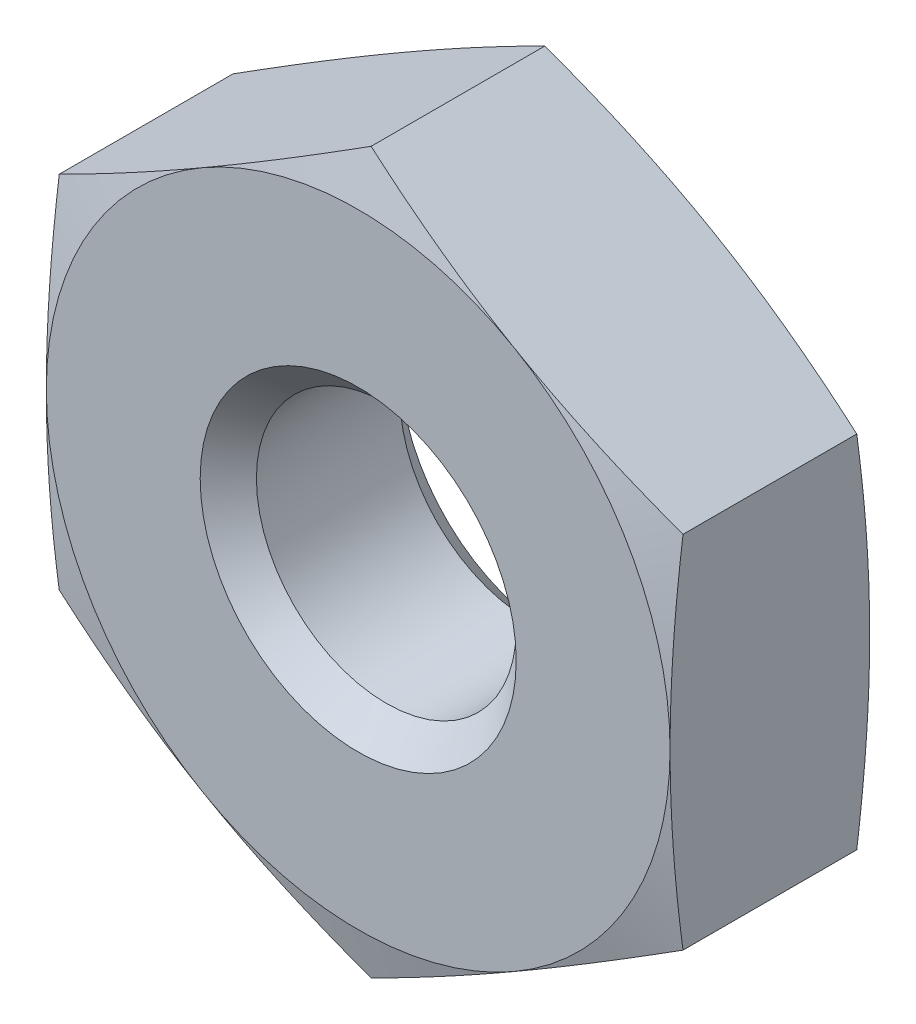
ISO-10303-21;
HEADER;
FILE_DESCRIPTION(('STEP AP214'),'2;1');
FILE_NAME('part.step','',(''),(''),'','','');
FILE_SCHEMA(('AUTOMOTIVE_DESIGN { 1 0 10303 214 1 1 1 1 }'));
ENDSEC;
DATA;
#1=APPLICATION_CONTEXT('core data for automotive mechanical design processes');
#2=APPLICATION_PROTOCOL_DEFINITION('international standard','automotive_design',2000,#1);
#3=PRODUCT_CONTEXT('',#1,'mechanical');
#4=PRODUCT('Part','Part','',(#3));
#5=PRODUCT_RELATED_PRODUCT_CATEGORY('part','',(#4));
#6=PRODUCT_DEFINITION_FORMATION('','',#4);
#7=PRODUCT_DEFINITION_CONTEXT('part definition',#1,'design');
#8=PRODUCT_DEFINITION('design','',#6,#7);
#9=PRODUCT_DEFINITION_SHAPE('','',#8);
#10=(LENGTH_UNIT() NAMED_UNIT(*) SI_UNIT(.MILLI.,.METRE.));
#11=(NAMED_UNIT(*) PLANE_ANGLE_UNIT() SI_UNIT($,.RADIAN.));
#12=(NAMED_UNIT(*) SI_UNIT($,.STERADIAN.) SOLID_ANGLE_UNIT());
#13=UNCERTAINTY_MEASURE_WITH_UNIT(LENGTH_MEASURE(1.E-05),#10,'distance_accuracy_value','');
#14=(GEOMETRIC_REPRESENTATION_CONTEXT(3) GLOBAL_UNCERTAINTY_ASSIGNED_CONTEXT((#13)) GLOBAL_UNIT_ASSIGNED_CONTEXT((#10,
#11,#12)) REPRESENTATION_CONTEXT('',''));
#15=CARTESIAN_POINT('',(0.,0.,0.));
#16=DIRECTION('',(0.,0.,1.));
#17=DIRECTION('',(1.,0.,0.));
#18=AXIS2_PLACEMENT_3D('',#15,#16,#17);
#19=CARTESIAN_POINT('',(0.,0.,0.));
#20=DIRECTION('',(0.,0.,-1.));
#21=DIRECTION('',(-1.,0.,0.));
#22=AXIS2_PLACEMENT_3D('',#19,#20,#21);
#23=PLANE('',#22);
#24=CARTESIAN_POINT('',(0.,0.,0.));
#25=DIRECTION('',(0.,0.,1.));
#26=DIRECTION('',(1.,0.,0.));
#27=AXIS2_PLACEMENT_3D('',#24,#25,#26);
#28=CIRCLE('',#27,4.7625);
#29=CARTESIAN_POINT('',(4.7625,0.,0.));
#30=VERTEX_POINT('',#29);
#31=CARTESIAN_POINT('',(2.38125000000001,4.1244459855234,0.));
#32=VERTEX_POINT('',#31);
#33=EDGE_CURVE('E11',#30,#32,#28,.T.);
#34=ORIENTED_EDGE('',*,*,#33,.T.);
#35=CARTESIAN_POINT('',(-2.38125000000001,4.1244459855234,0.));
#36=VERTEX_POINT('',#35);
#37=EDGE_CURVE('E43',#32,#36,#28,.T.);
#38=ORIENTED_EDGE('',*,*,#37,.T.);
#39=CARTESIAN_POINT('',(-4.7625,0.,0.));
#40=VERTEX_POINT('',#39);
#41=EDGE_CURVE('E328',#36,#40,#28,.T.);
#42=ORIENTED_EDGE('',*,*,#41,.T.);
#43=CARTESIAN_POINT('',(-2.38125000000001,-4.1244459855234,0.));
#44=VERTEX_POINT('',#43);
#45=EDGE_CURVE('E321',#40,#44,#28,.T.);
#46=ORIENTED_EDGE('',*,*,#45,.T.);
#47=CARTESIAN_POINT('',(2.38125000000001,-4.1244459855234,0.));
#48=VERTEX_POINT('',#47);
#49=EDGE_CURVE('E324',#44,#48,#28,.T.);
#50=ORIENTED_EDGE('',*,*,#49,.T.);
#51=EDGE_CURVE('E44',#48,#30,#28,.T.);
#52=ORIENTED_EDGE('',*,*,#51,.T.);
#53=EDGE_LOOP('',(#34,#38,#42,#46,#50,#52));
#54=FACE_BOUND('',#53,.T.);
#55=CARTESIAN_POINT('',(0.,0.,0.));
#56=DIRECTION('',(0.,0.,1.));
#57=DIRECTION('',(1.,0.,0.));
#58=AXIS2_PLACEMENT_3D('',#55,#56,#57);
#59=CIRCLE('',#58,2.413);
#60=CARTESIAN_POINT('',(2.413,0.,0.));
#61=VERTEX_POINT('',#60);
#62=EDGE_CURVE('E185',#61,#61,#59,.T.);
#63=ORIENTED_EDGE('',*,*,#62,.F.);
#64=EDGE_LOOP('',(#63));
#65=FACE_BOUND('',#64,.T.);
#66=ADVANCED_FACE('F36',(#54,#65),#23,.F.);
#67=CARTESIAN_POINT('',(0.,4.7625,-3.048));
#68=DIRECTION('',(0.,0.,1.));
#69=DIRECTION('',(1.,0.,0.));
#70=AXIS2_PLACEMENT_3D('',#67,#68,#69);
#71=PLANE('',#70);
#72=CARTESIAN_POINT('',(0.,0.,-3.048));
#73=DIRECTION('',(0.,0.,1.));
#74=DIRECTION('',(1.,0.,0.));
#75=AXIS2_PLACEMENT_3D('',#72,#73,#74);
#76=CIRCLE('',#75,4.7625);
#77=CARTESIAN_POINT('',(4.7625,0.,-3.048));
#78=VERTEX_POINT('',#77);
#79=CARTESIAN_POINT('',(2.38125000000001,4.1244459855234,-3.048));
#80=VERTEX_POINT('',#79);
#81=EDGE_CURVE('E359',#78,#80,#76,.T.);
#82=ORIENTED_EDGE('',*,*,#81,.F.);
#83=CARTESIAN_POINT('',(2.38125000000001,-4.1244459855234,-3.048));
#84=VERTEX_POINT('',#83);
#85=EDGE_CURVE('E362',#84,#78,#76,.T.);
#86=ORIENTED_EDGE('',*,*,#85,.F.);
#87=CARTESIAN_POINT('',(-2.38125000000001,-4.1244459855234,-3.048));
#88=VERTEX_POINT('',#87);
#89=EDGE_CURVE('E363',#88,#84,#76,.T.);
#90=ORIENTED_EDGE('',*,*,#89,.F.);
#91=CARTESIAN_POINT('',(-4.7625,0.,-3.048));
#92=VERTEX_POINT('',#91);
#93=EDGE_CURVE('E143',#92,#88,#76,.T.);
#94=ORIENTED_EDGE('',*,*,#93,.F.);
#95=CARTESIAN_POINT('',(-2.38125000000001,4.1244459855234,-3.048));
#96=VERTEX_POINT('',#95);
#97=EDGE_CURVE('E360',#96,#92,#76,.T.);
#98=ORIENTED_EDGE('',*,*,#97,.F.);
#99=EDGE_CURVE('E356',#80,#96,#76,.T.);
#100=ORIENTED_EDGE('',*,*,#99,.F.);
#101=EDGE_LOOP('',(#82,#86,#90,#94,#98,#100));
#102=FACE_BOUND('',#101,.T.);
#103=CARTESIAN_POINT('',(0.,0.,-3.048));
#104=DIRECTION('',(0.,0.,1.));
#105=DIRECTION('',(1.,0.,0.));
#106=AXIS2_PLACEMENT_3D('',#103,#104,#105);
#107=CIRCLE('',#106,2.413);
#108=CARTESIAN_POINT('',(2.413,0.,-3.048));
#109=VERTEX_POINT('',#108);
#110=EDGE_CURVE('E205',#109,#109,#107,.T.);
#111=ORIENTED_EDGE('',*,*,#110,.T.);
#112=EDGE_LOOP('',(#111));
#113=FACE_BOUND('',#112,.T.);
#114=ADVANCED_FACE('F209',(#102,#113),#71,.F.);
#115=CARTESIAN_POINT('',(0.,0.,-0.25522160579064));
#116=DIRECTION('',(0.,0.,-1.));
#117=DIRECTION('',(-1.,0.,0.));
#118=AXIS2_PLACEMENT_3D('',#115,#116,#117);
#119=CONICAL_SURFACE('',#118,5.715,1.30899693899575);
#120=CARTESIAN_POINT('',(-4.7627,2.74951518696176,-0.197445540191294));
#121=CARTESIAN_POINT('',(-4.56490877517695,2.86371000385669,-0.166833629235149));
#122=CARTESIAN_POINT('',(-4.36675892196618,2.97811187494782,-0.139043019383159));
#123=CARTESIAN_POINT('',(-3.96975940414776,3.20731965342844,-0.090217468531895));
#124=CARTESIAN_POINT('',(-3.77090948832601,3.32212570585646,-0.0691852718079106));
#125=CARTESIAN_POINT('',(-3.37371552682257,3.55144574645097,-0.0351044426334349));
#126=CARTESIAN_POINT('',(-3.17537416721689,3.66595818381074,-0.0220151656070741));
#127=CARTESIAN_POINT('',(-2.77843850081505,3.89512909765881,-0.0044637789460618));
#128=CARTESIAN_POINT('',(-2.57984425040752,4.0097875415911,0.));
#129=CARTESIAN_POINT('',(-2.18265574959247,4.2391044294557,0.));
#130=CARTESIAN_POINT('',(-1.98406149918495,4.35376287338799,-0.00446377894606255));
#131=CARTESIAN_POINT('',(-1.58712583278311,4.58293378723606,-0.0220151656070753));
#132=CARTESIAN_POINT('',(-1.38878447317743,4.69744622459584,-0.0351044426334363));
#133=CARTESIAN_POINT('',(-0.991590511673994,4.92676626519034,-0.0691852718079125));
#134=CARTESIAN_POINT('',(-0.79274059585224,5.04157231761836,-0.0902174685318972));
#135=CARTESIAN_POINT('',(-0.395741078033824,5.27078009609898,-0.139043019383162));
#136=CARTESIAN_POINT('',(-0.197591224823046,5.38518196719011,-0.166833629235152));
#137=CARTESIAN_POINT('',(0.000200000000000562,5.49937678408504,-0.197445540191297));
#138=B_SPLINE_CURVE_WITH_KNOTS('',3,(#120,#121,#122,#123,#124,#125,#126,#127,#128,#129,#130,
#131,#132,#133,#134,#135,#136,#137),.UNSPECIFIED.,.F.,.F.,(4,2,2,2,2,2,2,2,4),(0.,
0.691332271965001,1.38294490792359,2.07098798746551,2.75889789519172,3.44680780291792,
4.13485088245985,4.82646351841843,5.51779579038343),.UNSPECIFIED.);
#139=CARTESIAN_POINT('',(-4.7625,2.7496306570156,-0.197414599109147));
#140=VERTEX_POINT('',#139);
#141=EDGE_CURVE('E336',#140,#36,#138,.T.);
#142=ORIENTED_EDGE('',*,*,#141,.F.);
#143=CARTESIAN_POINT('',(-4.7625,-7.27378820104341,-1.05350026866726));
#144=CARTESIAN_POINT('',(-4.7625,-7.05772726305565,-1.00507832676799));
#145=CARTESIAN_POINT('',(-4.7625,-6.84153118574199,-0.957248587436731));
#146=CARTESIAN_POINT('',(-4.7625,-6.40880238366439,-0.863093170342623));
#147=CARTESIAN_POINT('',(-4.7625,-6.19226964478308,-0.81676755753862));
#148=CARTESIAN_POINT('',(-4.7625,-5.75860718227251,-0.725899735814738));
#149=CARTESIAN_POINT('',(-4.7625,-5.54147708139274,-0.681359320899419));
#150=CARTESIAN_POINT('',(-4.7625,-5.10676494415365,-0.594542660455404));
#151=CARTESIAN_POINT('',(-4.7625,-4.88918291162468,-0.552266395817578));
#152=CARTESIAN_POINT('',(-4.7625,-4.45522357117889,-0.470843012662113));
#153=CARTESIAN_POINT('',(-4.7625,-4.23885045336542,-0.431673672048276));
#154=CARTESIAN_POINT('',(-4.7625,-3.80551401793821,-0.356754667634231));
#155=CARTESIAN_POINT('',(-4.7625,-3.58855071341922,-0.321004928588058));
#156=CARTESIAN_POINT('',(-4.7625,-3.15399178662959,-0.253730066860368));
#157=CARTESIAN_POINT('',(-4.7625,-2.93639624557734,-0.222204424102948));
#158=CARTESIAN_POINT('',(-4.7625,-2.50051273157782,-0.164306764227813));
#159=CARTESIAN_POINT('',(-4.7625,-2.28222475798204,-0.137934751938309));
#160=CARTESIAN_POINT('',(-4.7625,-1.84249368491981,-0.0910911131261329));
#161=CARTESIAN_POINT('',(-4.7625,-1.62104295373776,-0.0706900639262618));
#162=CARTESIAN_POINT('',(-4.7625,-1.17758476151865,-0.0371957319502665));
#163=CARTESIAN_POINT('',(-4.7625,-0.955577313366654,-0.0241022815815293));
#164=CARTESIAN_POINT('',(-4.7625,-0.511327726224625,-0.00598680070252002));
#165=CARTESIAN_POINT('',(-4.7625,-0.289085739880909,-0.000961102236020668));
#166=CARTESIAN_POINT('',(-4.7625,0.155430183961466,0.000709849887994852));
#167=CARTESIAN_POINT('',(-4.7625,0.377704121432418,-0.00264488923023027));
#168=CARTESIAN_POINT('',(-4.7625,0.822780505992243,-0.017546022382038));
#169=CARTESIAN_POINT('',(-4.7625,1.04558193746731,-0.0291221471824264));
#170=CARTESIAN_POINT('',(-4.7625,1.49066069188238,-0.05980575965869));
#171=CARTESIAN_POINT('',(-4.7625,1.71293800310929,-0.0789134140749176));
#172=CARTESIAN_POINT('',(-4.7625,2.15696727018413,-0.123693062892535));
#173=CARTESIAN_POINT('',(-4.7625,2.37871878750097,-0.149369341214825));
#174=CARTESIAN_POINT('',(-4.7625,2.82150633529192,-0.206224697733119));
#175=CARTESIAN_POINT('',(-4.7625,3.04254236351744,-0.237403793205878));
#176=CARTESIAN_POINT('',(-4.7625,3.6753900052141,-0.333233763991723));
#177=CARTESIAN_POINT('',(-4.7625,4.0863537013855,-0.403456989945038));
#178=CARTESIAN_POINT('',(-4.7625,4.90636720913909,-0.55430442921292));
#179=CARTESIAN_POINT('',(-4.7625,5.31541677120842,-0.6349299613997));
#180=CARTESIAN_POINT('',(-4.7625,6.13216992988574,-0.80316417113105));
#181=CARTESIAN_POINT('',(-4.7625,6.53987317563588,-0.890774539174912));
#182=CARTESIAN_POINT('',(-4.7625,7.35419624322647,-1.07074688577446));
#183=CARTESIAN_POINT('',(-4.7625,7.76081612698248,-1.16310858638051));
#184=CARTESIAN_POINT('',(-4.7625,8.56928828454479,-1.35024707392398));
#185=CARTESIAN_POINT('',(-4.7625,8.97114814412675,-1.44499121070996));
#186=CARTESIAN_POINT('',(-4.7625,9.77430729039317,-1.6368520542413));
#187=CARTESIAN_POINT('',(-4.7625,10.1756065667243,-1.73396880420945));
#188=CARTESIAN_POINT('',(-4.7625,10.9772811149266,-1.92983378683962));
#189=CARTESIAN_POINT('',(-4.7625,11.3776569159364,-2.02857985831064));
#190=CARTESIAN_POINT('',(-4.7625,12.1780597656807,-2.22742035681909));
#191=CARTESIAN_POINT('',(-4.7625,12.5780868254884,-2.32751473925181));
#192=CARTESIAN_POINT('',(-4.7625,12.9779923445769,-2.42808669001593));
#193=B_SPLINE_CURVE_WITH_KNOTS('',3,(#143,#144,#145,#146,#147,#148,#149,#150,#151,#152,#153,
#154,#155,#156,#157,#158,#159,#160,#161,#162,#163,#164,#165,#166,#167,#168,#169,#170,#171,#172,
#173,#174,#175,#176,#177,#178,#179,#180,#181,#182,#183,#184,#185,#186,#187,#188,#189,#190,#191,
#192),.UNSPECIFIED.,.F.,.F.,(4,2,2,2,2,2,2,2,2,2,2,2,2,2,2,2,2,2,2,2,2,2,2,2,4),(0.,
0.6642640379174,1.32855672540963,1.99350104978659,2.65843976123677,3.3180875137926,
3.97772074791558,4.63727269241372,5.29682525481422,5.96388511231096,6.63092967081533,
7.29767087543394,7.96441150529626,8.63357560902586,9.30275452819558,9.97237098960278,
10.6419895533885,11.8925150523689,13.1431992572184,14.3941870821967,15.6451018082952,
16.8837244650886,18.1223697031849,19.3594864158202,20.5965623022993),.UNSPECIFIED.);
#194=EDGE_CURVE('E154',#40,#140,#193,.T.);
#195=ORIENTED_EDGE('',*,*,#194,.F.);
#196=ORIENTED_EDGE('',*,*,#41,.F.);
#197=EDGE_LOOP('',(#142,#195,#196));
#198=FACE_BOUND('',#197,.T.);
#199=ADVANCED_FACE('F227',(#198),#119,.T.);
#200=CARTESIAN_POINT('',(0.,5.4992613140312,-0.19741459910915));
#201=VERTEX_POINT('',#200);
#202=EDGE_CURVE('E333',#36,#201,#138,.T.);
#203=ORIENTED_EDGE('',*,*,#202,.F.);
#204=ORIENTED_EDGE('',*,*,#37,.F.);
#205=CARTESIAN_POINT('',(-0.000200000000000216,5.49937678408504,-0.197445540191297));
#206=CARTESIAN_POINT('',(0.197591224823046,5.38518196719011,-0.166833629235152));
#207=CARTESIAN_POINT('',(0.395741078033824,5.27078009609898,-0.139043019383161));
#208=CARTESIAN_POINT('',(0.792740595852239,5.04157231761836,-0.0902174685318972));
#209=CARTESIAN_POINT('',(0.991590511673994,4.92676626519034,-0.0691852718079125));
#210=CARTESIAN_POINT('',(1.38878447317743,4.69744622459584,-0.0351044426334362));
#211=CARTESIAN_POINT('',(1.58712583278311,4.58293378723606,-0.0220151656070753));
#212=CARTESIAN_POINT('',(1.98406149918495,4.35376287338799,-0.00446377894606248));
#213=CARTESIAN_POINT('',(2.18265574959247,4.2391044294557,0.));
#214=CARTESIAN_POINT('',(2.57984425040752,4.0097875415911,0.));
#215=CARTESIAN_POINT('',(2.77843850081505,3.89512909765881,-0.00446377894606186));
#216=CARTESIAN_POINT('',(3.17537416721689,3.66595818381074,-0.0220151656070741));
#217=CARTESIAN_POINT('',(3.37371552682257,3.55144574645097,-0.0351044426334347));
#218=CARTESIAN_POINT('',(3.77090948832601,3.32212570585646,-0.0691852718079104));
#219=CARTESIAN_POINT('',(3.96975940414776,3.20731965342844,-0.0902174685318949));
#220=CARTESIAN_POINT('',(4.36675892196618,2.97811187494782,-0.139043019383159));
#221=CARTESIAN_POINT('',(4.56490877517695,2.86371000385669,-0.166833629235149));
#222=CARTESIAN_POINT('',(4.7627,2.74951518696176,-0.197445540191294));
#223=B_SPLINE_CURVE_WITH_KNOTS('',3,(#205,#206,#207,#208,#209,#210,#211,#212,#213,#214,#215,
#216,#217,#218,#219,#220,#221,#222),.UNSPECIFIED.,.F.,.F.,(4,2,2,2,2,2,2,2,4),(0.,
0.691332271965001,1.38294490792359,2.07098798746551,2.75889789519172,3.44680780291792,
4.13485088245985,4.82646351841843,5.51779579038343),.UNSPECIFIED.);
#224=EDGE_CURVE('E266',#201,#32,#223,.T.);
#225=ORIENTED_EDGE('',*,*,#224,.F.);
#226=EDGE_LOOP('',(#203,#204,#225));
#227=FACE_BOUND('',#226,.T.);
#228=ADVANCED_FACE('F275',(#227),#119,.T.);
#229=CARTESIAN_POINT('',(4.7625,2.7496306570156,-0.197414599109147));
#230=VERTEX_POINT('',#229);
#231=EDGE_CURVE('E261',#32,#230,#223,.T.);
#232=ORIENTED_EDGE('',*,*,#231,.F.);
#233=ORIENTED_EDGE('',*,*,#33,.F.);
#234=CARTESIAN_POINT('',(4.7625,-7.27378820104341,-1.05350026866726));
#235=CARTESIAN_POINT('',(4.7625,-7.05772726305565,-1.00507832676799));
#236=CARTESIAN_POINT('',(4.7625,-6.84153118574199,-0.957248587436731));
#237=CARTESIAN_POINT('',(4.7625,-6.40880238366439,-0.863093170342623));
#238=CARTESIAN_POINT('',(4.7625,-6.19226964478308,-0.81676755753862));
#239=CARTESIAN_POINT('',(4.7625,-5.75860718227251,-0.725899735814738));
#240=CARTESIAN_POINT('',(4.7625,-5.54147708139274,-0.681359320899419));
#241=CARTESIAN_POINT('',(4.7625,-5.10676494415365,-0.594542660455404));
#242=CARTESIAN_POINT('',(4.7625,-4.88918291162468,-0.552266395817578));
#243=CARTESIAN_POINT('',(4.7625,-4.45522357117889,-0.470843012662113));
#244=CARTESIAN_POINT('',(4.7625,-4.23885045336542,-0.431673672048276));
#245=CARTESIAN_POINT('',(4.7625,-3.80551401793821,-0.356754667634231));
#246=CARTESIAN_POINT('',(4.7625,-3.58855071341922,-0.321004928588058));
#247=CARTESIAN_POINT('',(4.7625,-3.15399178662959,-0.253730066860368));
#248=CARTESIAN_POINT('',(4.7625,-2.93639624557734,-0.222204424102948));
#249=CARTESIAN_POINT('',(4.7625,-2.50051273157782,-0.164306764227813));
#250=CARTESIAN_POINT('',(4.7625,-2.28222475798204,-0.137934751938309));
#251=CARTESIAN_POINT('',(4.7625,-1.84249368491981,-0.0910911131261329));
#252=CARTESIAN_POINT('',(4.7625,-1.62104295373776,-0.0706900639262618));
#253=CARTESIAN_POINT('',(4.7625,-1.17758476151865,-0.0371957319502665));
#254=CARTESIAN_POINT('',(4.7625,-0.955577313366654,-0.0241022815815293));
#255=CARTESIAN_POINT('',(4.7625,-0.511327726224625,-0.00598680070252002));
#256=CARTESIAN_POINT('',(4.7625,-0.289085739880909,-0.000961102236020668));
#257=CARTESIAN_POINT('',(4.7625,0.155430183961466,0.000709849887994852));
#258=CARTESIAN_POINT('',(4.7625,0.377704121432418,-0.00264488923023027));
#259=CARTESIAN_POINT('',(4.7625,0.822780505992243,-0.017546022382038));
#260=CARTESIAN_POINT('',(4.7625,1.04558193746731,-0.0291221471824264));
#261=CARTESIAN_POINT('',(4.7625,1.49066069188238,-0.05980575965869));
#262=CARTESIAN_POINT('',(4.7625,1.71293800310929,-0.0789134140749176));
#263=CARTESIAN_POINT('',(4.7625,2.15696727018413,-0.123693062892535));
#264=CARTESIAN_POINT('',(4.7625,2.37871878750097,-0.149369341214825));
#265=CARTESIAN_POINT('',(4.7625,2.82150633529192,-0.206224697733119));
#266=CARTESIAN_POINT('',(4.7625,3.04254236351744,-0.237403793205878));
#267=CARTESIAN_POINT('',(4.7625,3.6753900052141,-0.333233763991723));
#268=CARTESIAN_POINT('',(4.7625,4.0863537013855,-0.403456989945038));
#269=CARTESIAN_POINT('',(4.7625,4.90636720913909,-0.55430442921292));
#270=CARTESIAN_POINT('',(4.7625,5.31541677120842,-0.6349299613997));
#271=CARTESIAN_POINT('',(4.7625,6.13216992988574,-0.80316417113105));
#272=CARTESIAN_POINT('',(4.7625,6.53987317563588,-0.890774539174912));
#273=CARTESIAN_POINT('',(4.7625,7.35419624322647,-1.07074688577446));
#274=CARTESIAN_POINT('',(4.7625,7.76081612698248,-1.16310858638051));
#275=CARTESIAN_POINT('',(4.7625,8.56928828454479,-1.35024707392398));
#276=CARTESIAN_POINT('',(4.7625,8.97114814412675,-1.44499121070996));
#277=CARTESIAN_POINT('',(4.7625,9.77430729039317,-1.6368520542413));
#278=CARTESIAN_POINT('',(4.7625,10.1756065667243,-1.73396880420945));
#279=CARTESIAN_POINT('',(4.7625,10.9772811149266,-1.92983378683962));
#280=CARTESIAN_POINT('',(4.7625,11.3776569159364,-2.02857985831064));
#281=CARTESIAN_POINT('',(4.7625,12.1780597656807,-2.22742035681909));
#282=CARTESIAN_POINT('',(4.7625,12.5780868254884,-2.32751473925181));
#283=CARTESIAN_POINT('',(4.7625,12.9779923445769,-2.42808669001593));
#284=B_SPLINE_CURVE_WITH_KNOTS('',3,(#234,#235,#236,#237,#238,#239,#240,#241,#242,#243,#244,
#245,#246,#247,#248,#249,#250,#251,#252,#253,#254,#255,#256,#257,#258,#259,#260,#261,#262,#263,
#264,#265,#266,#267,#268,#269,#270,#271,#272,#273,#274,#275,#276,#277,#278,#279,#280,#281,#282,
#283),.UNSPECIFIED.,.F.,.F.,(4,2,2,2,2,2,2,2,2,2,2,2,2,2,2,2,2,2,2,2,2,2,2,2,4),(0.,
0.6642640379174,1.32855672540963,1.99350104978659,2.65843976123677,3.3180875137926,
3.97772074791558,4.63727269241372,5.29682525481422,5.96388511231096,6.63092967081533,
7.29767087543394,7.96441150529626,8.63357560902586,9.30275452819558,9.97237098960278,
10.6419895533885,11.8925150523689,13.1431992572184,14.3941870821967,15.6451018082952,
16.8837244650886,18.1223697031849,19.3594864158202,20.5965623022993),.UNSPECIFIED.);
#285=EDGE_CURVE('E293',#230,#30,#284,.F.);
#286=ORIENTED_EDGE('',*,*,#285,.F.);
#287=EDGE_LOOP('',(#232,#233,#286));
#288=FACE_BOUND('',#287,.T.);
#289=ADVANCED_FACE('F347',(#288),#119,.T.);
#290=CARTESIAN_POINT('',(4.7625,-2.7496306570156,-0.197414599109147));
#291=VERTEX_POINT('',#290);
#292=EDGE_CURVE('E289',#30,#291,#284,.F.);
#293=ORIENTED_EDGE('',*,*,#292,.F.);
#294=ORIENTED_EDGE('',*,*,#51,.F.);
#295=CARTESIAN_POINT('',(4.7627,-2.74951518696176,-0.197445540191294));
#296=CARTESIAN_POINT('',(4.56490877517695,-2.86371000385669,-0.166833629235149));
#297=CARTESIAN_POINT('',(4.36675892196618,-2.97811187494782,-0.139043019383159));
#298=CARTESIAN_POINT('',(3.96975940414776,-3.20731965342844,-0.090217468531895));
#299=CARTESIAN_POINT('',(3.77090948832601,-3.32212570585646,-0.0691852718079106));
#300=CARTESIAN_POINT('',(3.37371552682257,-3.55144574645097,-0.0351044426334349));
#301=CARTESIAN_POINT('',(3.17537416721689,-3.66595818381074,-0.0220151656070741));
#302=CARTESIAN_POINT('',(2.77843850081505,-3.89512909765881,-0.0044637789460618));
#303=CARTESIAN_POINT('',(2.57984425040752,-4.0097875415911,0.));
#304=CARTESIAN_POINT('',(2.18265574959247,-4.2391044294557,0.));
#305=CARTESIAN_POINT('',(1.98406149918495,-4.35376287338799,-0.00446377894606255));
#306=CARTESIAN_POINT('',(1.58712583278311,-4.58293378723606,-0.0220151656070753));
#307=CARTESIAN_POINT('',(1.38878447317743,-4.69744622459584,-0.0351044426334363));
#308=CARTESIAN_POINT('',(0.991590511673994,-4.92676626519034,-0.0691852718079125));
#309=CARTESIAN_POINT('',(0.79274059585224,-5.04157231761836,-0.0902174685318972));
#310=CARTESIAN_POINT('',(0.395741078033824,-5.27078009609898,-0.139043019383162));
#311=CARTESIAN_POINT('',(0.197591224823046,-5.38518196719011,-0.166833629235152));
#312=CARTESIAN_POINT('',(-0.000200000000000562,-5.49937678408504,-0.197445540191297));
#313=B_SPLINE_CURVE_WITH_KNOTS('',3,(#295,#296,#297,#298,#299,#300,#301,#302,#303,#304,#305,
#306,#307,#308,#309,#310,#311,#312),.UNSPECIFIED.,.F.,.F.,(4,2,2,2,2,2,2,2,4),(0.,
0.691332271965001,1.38294490792359,2.07098798746551,2.75889789519172,3.44680780291792,
4.13485088245985,4.82646351841843,5.51779579038343),.UNSPECIFIED.);
#314=EDGE_CURVE('E299',#291,#48,#313,.T.);
#315=ORIENTED_EDGE('',*,*,#314,.F.);
#316=EDGE_LOOP('',(#293,#294,#315));
#317=FACE_BOUND('',#316,.T.);
#318=ADVANCED_FACE('F387',(#317),#119,.T.);
#319=CARTESIAN_POINT('',(0.,-5.4992613140312,-0.19741459910915));
#320=VERTEX_POINT('',#319);
#321=EDGE_CURVE('E284',#48,#320,#313,.T.);
#322=ORIENTED_EDGE('',*,*,#321,.F.);
#323=ORIENTED_EDGE('',*,*,#49,.F.);
#324=CARTESIAN_POINT('',(0.000200000000000216,-5.49937678408504,-0.197445540191297));
#325=CARTESIAN_POINT('',(-0.197591224823046,-5.38518196719011,-0.166833629235152));
#326=CARTESIAN_POINT('',(-0.395741078033824,-5.27078009609898,-0.139043019383161));
#327=CARTESIAN_POINT('',(-0.792740595852239,-5.04157231761836,-0.0902174685318972));
#328=CARTESIAN_POINT('',(-0.991590511673994,-4.92676626519034,-0.0691852718079125));
#329=CARTESIAN_POINT('',(-1.38878447317743,-4.69744622459584,-0.0351044426334362));
#330=CARTESIAN_POINT('',(-1.58712583278311,-4.58293378723606,-0.0220151656070753));
#331=CARTESIAN_POINT('',(-1.98406149918495,-4.35376287338799,-0.00446377894606248));
#332=CARTESIAN_POINT('',(-2.18265574959247,-4.2391044294557,0.));
#333=CARTESIAN_POINT('',(-2.57984425040752,-4.0097875415911,0.));
#334=CARTESIAN_POINT('',(-2.77843850081505,-3.89512909765881,-0.00446377894606186));
#335=CARTESIAN_POINT('',(-3.17537416721689,-3.66595818381074,-0.0220151656070741));
#336=CARTESIAN_POINT('',(-3.37371552682257,-3.55144574645097,-0.0351044426334347));
#337=CARTESIAN_POINT('',(-3.77090948832601,-3.32212570585646,-0.0691852718079104));
#338=CARTESIAN_POINT('',(-3.96975940414776,-3.20731965342844,-0.0902174685318949));
#339=CARTESIAN_POINT('',(-4.36675892196618,-2.97811187494782,-0.139043019383159));
#340=CARTESIAN_POINT('',(-4.56490877517695,-2.86371000385669,-0.166833629235149));
#341=CARTESIAN_POINT('',(-4.7627,-2.74951518696176,-0.197445540191294));
#342=B_SPLINE_CURVE_WITH_KNOTS('',3,(#324,#325,#326,#327,#328,#329,#330,#331,#332,#333,#334,
#335,#336,#337,#338,#339,#340,#341),.UNSPECIFIED.,.F.,.F.,(4,2,2,2,2,2,2,2,4),(0.,
0.691332271965001,1.38294490792359,2.07098798746551,2.75889789519172,3.44680780291792,
4.13485088245985,4.82646351841843,5.51779579038343),.UNSPECIFIED.);
#343=EDGE_CURVE('E146',#320,#44,#342,.T.);
#344=ORIENTED_EDGE('',*,*,#343,.F.);
#345=EDGE_LOOP('',(#322,#323,#344));
#346=FACE_BOUND('',#345,.T.);
#347=ADVANCED_FACE('F325',(#346),#119,.T.);
#348=CARTESIAN_POINT('',(-4.7625,-2.7496306570156,-0.197414599109147));
#349=VERTEX_POINT('',#348);
#350=EDGE_CURVE('E138',#44,#349,#342,.T.);
#351=ORIENTED_EDGE('',*,*,#350,.F.);
#352=ORIENTED_EDGE('',*,*,#45,.F.);
#353=EDGE_CURVE('E51',#349,#40,#193,.T.);
#354=ORIENTED_EDGE('',*,*,#353,.F.);
#355=EDGE_LOOP('',(#351,#352,#354));
#356=FACE_BOUND('',#355,.T.);
#357=ADVANCED_FACE('F277',(#356),#119,.T.);
#358=CARTESIAN_POINT('',(0.,5.4992613140312,-3.048));
#359=DIRECTION('',(-0.500000000000001,0.866025403784438,0.));
#360=DIRECTION('',(-0.866025403784438,-0.500000000000001,0.));
#361=AXIS2_PLACEMENT_3D('',#358,#359,#360);
#362=PLANE('',#361);
#363=ORIENTED_EDGE('',*,*,#141,.T.);
#364=ORIENTED_EDGE('',*,*,#202,.T.);
#365=DIRECTION('',(0.,0.,1.));
#366=VECTOR('',#365,1.);
#367=CARTESIAN_POINT('',(0.,5.4992613140312,-3.048));
#368=LINE('',#367,#366);
#369=CARTESIAN_POINT('',(0.,5.4992613140312,-2.85058540089088));
#370=VERTEX_POINT('',#369);
#371=EDGE_CURVE('E131',#370,#201,#368,.T.);
#372=ORIENTED_EDGE('',*,*,#371,.F.);
#373=CARTESIAN_POINT('',(0.000200000000000035,5.49937678408504,-2.85055445980873));
#374=CARTESIAN_POINT('',(-0.197591224823046,5.38518196719011,-2.88116637076487));
#375=CARTESIAN_POINT('',(-0.395741078033824,5.27078009609898,-2.90895698061686));
#376=CARTESIAN_POINT('',(-0.79274059585224,5.04157231761836,-2.95778253146812));
#377=CARTESIAN_POINT('',(-0.991590511673994,4.92676626519034,-2.9788147281921));
#378=CARTESIAN_POINT('',(-1.38878447317743,4.69744622459584,-3.01289555736657));
#379=CARTESIAN_POINT('',(-1.58712583278311,4.58293378723606,-3.02598483439293));
#380=CARTESIAN_POINT('',(-1.98406149918495,4.35376287338799,-3.04353622105394));
#381=CARTESIAN_POINT('',(-2.18265574959247,4.2391044294557,-3.048));
#382=CARTESIAN_POINT('',(-2.57984425040752,4.0097875415911,-3.048));
#383=CARTESIAN_POINT('',(-2.77843850081505,3.89512909765881,-3.04353622105394));
#384=CARTESIAN_POINT('',(-3.17537416721689,3.66595818381074,-3.02598483439293));
#385=CARTESIAN_POINT('',(-3.37371552682257,3.55144574645097,-3.01289555736657));
#386=CARTESIAN_POINT('',(-3.77090948832601,3.32212570585646,-2.9788147281921));
#387=CARTESIAN_POINT('',(-3.96975940414776,3.20731965342844,-2.95778253146812));
#388=CARTESIAN_POINT('',(-4.36675892196618,2.97811187494782,-2.90895698061686));
#389=CARTESIAN_POINT('',(-4.56490877517695,2.86371000385669,-2.88116637076488));
#390=CARTESIAN_POINT('',(-4.7627,2.74951518696176,-2.85055445980874));
#391=B_SPLINE_CURVE_WITH_KNOTS('',3,(#373,#374,#375,#376,#377,#378,#379,#380,#381,#382,#383,
#384,#385,#386,#387,#388,#389,#390),.UNSPECIFIED.,.F.,.F.,(4,2,2,2,2,2,2,2,4),(0.,
0.691332271964999,1.38294490792358,2.07098798746551,2.75889789519171,3.44680780291792,
4.13485088245984,4.82646351841843,5.51779579038343),.UNSPECIFIED.);
#392=EDGE_CURVE('E337',#370,#96,#391,.T.);
#393=ORIENTED_EDGE('',*,*,#392,.T.);
#394=CARTESIAN_POINT('',(-4.7625,2.7496306570156,-2.85058540089088));
#395=VERTEX_POINT('',#394);
#396=EDGE_CURVE('E268',#96,#395,#391,.T.);
#397=ORIENTED_EDGE('',*,*,#396,.T.);
#398=DIRECTION('',(0.,0.,1.));
#399=VECTOR('',#398,1.);
#400=CARTESIAN_POINT('',(-4.7625,2.7496306570156,-3.048));
#401=LINE('',#400,#399);
#402=EDGE_CURVE('E140',#395,#140,#401,.T.);
#403=ORIENTED_EDGE('',*,*,#402,.T.);
#404=EDGE_LOOP('',(#363,#364,#372,#393,#397,#403));
#405=FACE_BOUND('',#404,.T.);
#406=ADVANCED_FACE('F177',(#405),#362,.T.);
#407=CARTESIAN_POINT('',(4.7625,2.7496306570156,-3.048));
#408=DIRECTION('',(0.500000000000001,0.866025403784438,0.));
#409=DIRECTION('',(-0.866025403784438,0.500000000000001,0.));
#410=AXIS2_PLACEMENT_3D('',#407,#408,#409);
#411=PLANE('',#410);
#412=ORIENTED_EDGE('',*,*,#224,.T.);
#413=ORIENTED_EDGE('',*,*,#231,.T.);
#414=DIRECTION('',(0.,0.,1.));
#415=VECTOR('',#414,1.);
#416=CARTESIAN_POINT('',(4.7625,2.7496306570156,-3.048));
#417=LINE('',#416,#415);
#418=CARTESIAN_POINT('',(4.7625,2.7496306570156,-2.85058540089088));
#419=VERTEX_POINT('',#418);
#420=EDGE_CURVE('E192',#419,#230,#417,.T.);
#421=ORIENTED_EDGE('',*,*,#420,.F.);
#422=CARTESIAN_POINT('',(4.7627,2.74951518696176,-2.85055445980874));
#423=CARTESIAN_POINT('',(4.56490877517695,2.86371000385669,-2.88116637076488));
#424=CARTESIAN_POINT('',(4.36675892196618,2.97811187494782,-2.90895698061686));
#425=CARTESIAN_POINT('',(3.96975940414776,3.20731965342844,-2.95778253146812));
#426=CARTESIAN_POINT('',(3.77090948832601,3.32212570585646,-2.9788147281921));
#427=CARTESIAN_POINT('',(3.37371552682257,3.55144574645097,-3.01289555736657));
#428=CARTESIAN_POINT('',(3.17537416721689,3.66595818381074,-3.02598483439293));
#429=CARTESIAN_POINT('',(2.77843850081505,3.89512909765881,-3.04353622105394));
#430=CARTESIAN_POINT('',(2.57984425040752,4.0097875415911,-3.048));
#431=CARTESIAN_POINT('',(2.18265574959247,4.2391044294557,-3.048));
#432=CARTESIAN_POINT('',(1.98406149918495,4.353762873388,-3.04353622105394));
#433=CARTESIAN_POINT('',(1.58712583278311,4.58293378723606,-3.02598483439293));
#434=CARTESIAN_POINT('',(1.38878447317743,4.69744622459584,-3.01289555736657));
#435=CARTESIAN_POINT('',(0.991590511673993,4.92676626519034,-2.9788147281921));
#436=CARTESIAN_POINT('',(0.792740595852239,5.04157231761836,-2.95778253146812));
#437=CARTESIAN_POINT('',(0.395741078033824,5.27078009609898,-2.90895698061686));
#438=CARTESIAN_POINT('',(0.197591224823046,5.38518196719011,-2.88116637076487));
#439=CARTESIAN_POINT('',(-0.000200000000000554,5.49937678408504,-2.85055445980873));
#440=B_SPLINE_CURVE_WITH_KNOTS('',3,(#422,#423,#424,#425,#426,#427,#428,#429,#430,#431,#432,
#433,#434,#435,#436,#437,#438,#439),.UNSPECIFIED.,.F.,.F.,(4,2,2,2,2,2,2,2,4),(0.,
0.691332271964999,1.38294490792358,2.07098798746551,2.75889789519171,3.44680780291792,
4.13485088245984,4.82646351841843,5.51779579038343),.UNSPECIFIED.);
#441=EDGE_CURVE('E267',#419,#80,#440,.T.);
#442=ORIENTED_EDGE('',*,*,#441,.T.);
#443=EDGE_CURVE('E255',#80,#370,#440,.T.);
#444=ORIENTED_EDGE('',*,*,#443,.T.);
#445=ORIENTED_EDGE('',*,*,#371,.T.);
#446=EDGE_LOOP('',(#412,#413,#421,#442,#444,#445));
#447=FACE_BOUND('',#446,.T.);
#448=ADVANCED_FACE('F247',(#447),#411,.T.);
#449=CARTESIAN_POINT('',(4.7625,-2.7496306570156,-3.048));
#450=DIRECTION('',(1.,0.,0.));
#451=DIRECTION('',(0.,0.,-1.));
#452=AXIS2_PLACEMENT_3D('',#449,#450,#451);
#453=PLANE('',#452);
#454=ORIENTED_EDGE('',*,*,#285,.T.);
#455=ORIENTED_EDGE('',*,*,#292,.T.);
#456=DIRECTION('',(0.,0.,1.));
#457=VECTOR('',#456,1.);
#458=CARTESIAN_POINT('',(4.7625,-2.7496306570156,-3.048));
#459=LINE('',#458,#457);
#460=CARTESIAN_POINT('',(4.7625,-2.7496306570156,-2.85058540089088));
#461=VERTEX_POINT('',#460);
#462=EDGE_CURVE('E189',#461,#291,#459,.T.);
#463=ORIENTED_EDGE('',*,*,#462,.F.);
#464=CARTESIAN_POINT('',(4.7625,-7.2737882010434,-1.99449973133291));
#465=CARTESIAN_POINT('',(4.7625,-7.05772726305565,-2.04292167323217));
#466=CARTESIAN_POINT('',(4.7625,-6.84153118574198,-2.09075141256342));
#467=CARTESIAN_POINT('',(4.7625,-6.40880238366439,-2.18490682965751));
#468=CARTESIAN_POINT('',(4.7625,-6.19226964478308,-2.23123244246151));
#469=CARTESIAN_POINT('',(4.7625,-5.7586071822725,-2.32210026418538));
#470=CARTESIAN_POINT('',(4.7625,-5.54147708139273,-2.36664067910069));
#471=CARTESIAN_POINT('',(4.7625,-5.10676494415365,-2.45345733954469));
#472=CARTESIAN_POINT('',(4.7625,-4.88918291162468,-2.49573360418251));
#473=CARTESIAN_POINT('',(4.7625,-4.45522357117888,-2.57715698733796));
#474=CARTESIAN_POINT('',(4.7625,-4.23885045336541,-2.61632632795179));
#475=CARTESIAN_POINT('',(4.7625,-3.80551401793821,-2.69124533236583));
#476=CARTESIAN_POINT('',(4.7625,-3.58855071341921,-2.72699507141199));
#477=CARTESIAN_POINT('',(4.7625,-3.15399178662959,-2.79426993313967));
#478=CARTESIAN_POINT('',(4.7625,-2.93639624557734,-2.82579557589709));
#479=CARTESIAN_POINT('',(4.7625,-2.50051273157782,-2.88369323577221));
#480=CARTESIAN_POINT('',(4.7625,-2.28222475798204,-2.91006524806171));
#481=CARTESIAN_POINT('',(4.7625,-1.84249368491981,-2.95690888687388));
#482=CARTESIAN_POINT('',(4.7625,-1.62104295373776,-2.97730993607375));
#483=CARTESIAN_POINT('',(4.7625,-1.17758476151866,-3.01080426804974));
#484=CARTESIAN_POINT('',(4.7625,-0.955577313366663,-3.02389771841847));
#485=CARTESIAN_POINT('',(4.7625,-0.511327726224637,-3.04201319929748));
#486=CARTESIAN_POINT('',(4.7625,-0.289085739880924,-3.04703889776398));
#487=CARTESIAN_POINT('',(4.7625,0.155430183961448,-3.04870984988799));
#488=CARTESIAN_POINT('',(4.7625,0.377704121432397,-3.04535511076977));
#489=CARTESIAN_POINT('',(4.7625,0.822780505992219,-3.03045397761797));
#490=CARTESIAN_POINT('',(4.7625,1.04558193746728,-3.01887785281758));
#491=CARTESIAN_POINT('',(4.7625,1.49066069188235,-2.98819424034132));
#492=CARTESIAN_POINT('',(4.7625,1.71293800310926,-2.9690865859251));
#493=CARTESIAN_POINT('',(4.7625,2.1569672701841,-2.92430693710749));
#494=CARTESIAN_POINT('',(4.7625,2.37871878750094,-2.8986306587852));
#495=CARTESIAN_POINT('',(4.7625,2.82150633529188,-2.84177530226692));
#496=CARTESIAN_POINT('',(4.7625,3.0425423635174,-2.81059620679417));
#497=CARTESIAN_POINT('',(4.7625,3.67539000521405,-2.71476623600834));
#498=CARTESIAN_POINT('',(4.7625,4.08635370138546,-2.64454301005503));
#499=CARTESIAN_POINT('',(4.7625,4.90636720913905,-2.49369557078718));
#500=CARTESIAN_POINT('',(4.7625,5.31541677120838,-2.41307003860041));
#501=CARTESIAN_POINT('',(4.7625,6.1321699298857,-2.24483582886909));
#502=CARTESIAN_POINT('',(4.7625,6.53987317563585,-2.15722546082524));
#503=CARTESIAN_POINT('',(4.7625,7.35419624322644,-1.97725311422571));
#504=CARTESIAN_POINT('',(4.7625,7.76081612698245,-1.88489141361968));
#505=CARTESIAN_POINT('',(4.7625,8.56928828454477,-1.69775292607624));
#506=CARTESIAN_POINT('',(4.7625,8.97114814412673,-1.60300878929027));
#507=CARTESIAN_POINT('',(4.7625,9.77430729039316,-1.41114794575896));
#508=CARTESIAN_POINT('',(4.7625,10.1756065667243,-1.31403119579083));
#509=CARTESIAN_POINT('',(4.7625,10.9772811149266,-1.11816621316068));
#510=CARTESIAN_POINT('',(4.7625,11.3776569159364,-1.01942014168968));
#511=CARTESIAN_POINT('',(4.7625,12.1780597656807,-0.820579643181263));
#512=CARTESIAN_POINT('',(4.7625,12.5780868254884,-0.720485260748552));
#513=CARTESIAN_POINT('',(4.7625,12.9779923445769,-0.619913309984454));
#514=B_SPLINE_CURVE_WITH_KNOTS('',3,(#464,#465,#466,#467,#468,#469,#470,#471,#472,#473,#474,
#475,#476,#477,#478,#479,#480,#481,#482,#483,#484,#485,#486,#487,#488,#489,#490,#491,#492,#493,
#494,#495,#496,#497,#498,#499,#500,#501,#502,#503,#504,#505,#506,#507,#508,#509,#510,#511,#512,
#513),.UNSPECIFIED.,.F.,.F.,(4,2,2,2,2,2,2,2,2,2,2,2,2,2,2,2,2,2,2,2,2,2,2,2,4),(0.,
0.664264037917396,1.32855672540963,1.99350104978658,2.65843976123675,3.31808751379258,
3.97772074791555,4.63727269241369,5.29682525481419,5.96388511231092,6.63092967081528,
7.29767087543389,7.96441150529621,8.6335756090258,9.30275452819551,9.97237098960271,
10.6419895533884,11.8925150523688,13.1431992572183,14.3941870821966,15.6451018082951,
16.8837244650885,18.1223697031848,19.3594864158201,20.5965623022992),.UNSPECIFIED.);
#515=EDGE_CURVE('E294',#461,#78,#514,.T.);
#516=ORIENTED_EDGE('',*,*,#515,.T.);
#517=EDGE_CURVE('E295',#78,#419,#514,.T.);
#518=ORIENTED_EDGE('',*,*,#517,.T.);
#519=ORIENTED_EDGE('',*,*,#420,.T.);
#520=EDGE_LOOP('',(#454,#455,#463,#516,#518,#519));
#521=FACE_BOUND('',#520,.T.);
#522=ADVANCED_FACE('F250',(#521),#453,.T.);
#523=CARTESIAN_POINT('',(0.,-5.4992613140312,-3.048));
#524=DIRECTION('',(0.500000000000001,-0.866025403784438,0.));
#525=DIRECTION('',(0.866025403784438,0.500000000000001,0.));
#526=AXIS2_PLACEMENT_3D('',#523,#524,#525);
#527=PLANE('',#526);
#528=ORIENTED_EDGE('',*,*,#314,.T.);
#529=ORIENTED_EDGE('',*,*,#321,.T.);
#530=DIRECTION('',(0.,0.,1.));
#531=VECTOR('',#530,1.);
#532=CARTESIAN_POINT('',(0.,-5.4992613140312,-3.048));
#533=LINE('',#532,#531);
#534=CARTESIAN_POINT('',(0.,-5.4992613140312,-2.85058540089088));
#535=VERTEX_POINT('',#534);
#536=EDGE_CURVE('E139',#535,#320,#533,.T.);
#537=ORIENTED_EDGE('',*,*,#536,.F.);
#538=CARTESIAN_POINT('',(-0.000200000000000035,-5.49937678408504,-2.85055445980873));
#539=CARTESIAN_POINT('',(0.197591224823046,-5.38518196719011,-2.88116637076487));
#540=CARTESIAN_POINT('',(0.395741078033824,-5.27078009609898,-2.90895698061686));
#541=CARTESIAN_POINT('',(0.79274059585224,-5.04157231761836,-2.95778253146812));
#542=CARTESIAN_POINT('',(0.991590511673994,-4.92676626519034,-2.9788147281921));
#543=CARTESIAN_POINT('',(1.38878447317743,-4.69744622459584,-3.01289555736657));
#544=CARTESIAN_POINT('',(1.58712583278311,-4.58293378723606,-3.02598483439293));
#545=CARTESIAN_POINT('',(1.98406149918495,-4.35376287338799,-3.04353622105394));
#546=CARTESIAN_POINT('',(2.18265574959247,-4.2391044294557,-3.048));
#547=CARTESIAN_POINT('',(2.57984425040752,-4.0097875415911,-3.048));
#548=CARTESIAN_POINT('',(2.77843850081505,-3.89512909765881,-3.04353622105394));
#549=CARTESIAN_POINT('',(3.17537416721689,-3.66595818381074,-3.02598483439293));
#550=CARTESIAN_POINT('',(3.37371552682257,-3.55144574645097,-3.01289555736657));
#551=CARTESIAN_POINT('',(3.77090948832601,-3.32212570585646,-2.9788147281921));
#552=CARTESIAN_POINT('',(3.96975940414776,-3.20731965342844,-2.95778253146812));
#553=CARTESIAN_POINT('',(4.36675892196618,-2.97811187494782,-2.90895698061686));
#554=CARTESIAN_POINT('',(4.56490877517695,-2.86371000385669,-2.88116637076488));
#555=CARTESIAN_POINT('',(4.7627,-2.74951518696176,-2.85055445980874));
#556=B_SPLINE_CURVE_WITH_KNOTS('',3,(#538,#539,#540,#541,#542,#543,#544,#545,#546,#547,#548,
#549,#550,#551,#552,#553,#554,#555),.UNSPECIFIED.,.F.,.F.,(4,2,2,2,2,2,2,2,4),(0.,
0.691332271964999,1.38294490792358,2.07098798746551,2.75889789519171,3.44680780291792,
4.13485088245984,4.82646351841843,5.51779579038343),.UNSPECIFIED.);
#557=EDGE_CURVE('E306',#535,#84,#556,.T.);
#558=ORIENTED_EDGE('',*,*,#557,.T.);
#559=EDGE_CURVE('E308',#84,#461,#556,.T.);
#560=ORIENTED_EDGE('',*,*,#559,.T.);
#561=ORIENTED_EDGE('',*,*,#462,.T.);
#562=EDGE_LOOP('',(#528,#529,#537,#558,#560,#561));
#563=FACE_BOUND('',#562,.T.);
#564=ADVANCED_FACE('F169',(#563),#527,.T.);
#565=CARTESIAN_POINT('',(-4.7625,-2.7496306570156,-3.048));
#566=DIRECTION('',(-0.500000000000001,-0.866025403784438,0.));
#567=DIRECTION('',(0.866025403784438,-0.500000000000001,0.));
#568=AXIS2_PLACEMENT_3D('',#565,#566,#567);
#569=PLANE('',#568);
#570=ORIENTED_EDGE('',*,*,#343,.T.);
#571=ORIENTED_EDGE('',*,*,#350,.T.);
#572=DIRECTION('',(0.,0.,1.));
#573=VECTOR('',#572,1.);
#574=CARTESIAN_POINT('',(-4.7625,-2.7496306570156,-3.048));
#575=LINE('',#574,#573);
#576=CARTESIAN_POINT('',(-4.7625,-2.7496306570156,-2.85058540089088));
#577=VERTEX_POINT('',#576);
#578=EDGE_CURVE('E126',#577,#349,#575,.T.);
#579=ORIENTED_EDGE('',*,*,#578,.F.);
#580=CARTESIAN_POINT('',(-4.7627,-2.74951518696176,-2.85055445980874));
#581=CARTESIAN_POINT('',(-4.56490877517695,-2.86371000385669,-2.88116637076488));
#582=CARTESIAN_POINT('',(-4.36675892196618,-2.97811187494782,-2.90895698061686));
#583=CARTESIAN_POINT('',(-3.96975940414776,-3.20731965342844,-2.95778253146812));
#584=CARTESIAN_POINT('',(-3.77090948832601,-3.32212570585646,-2.9788147281921));
#585=CARTESIAN_POINT('',(-3.37371552682257,-3.55144574645097,-3.01289555736657));
#586=CARTESIAN_POINT('',(-3.17537416721689,-3.66595818381074,-3.02598483439293));
#587=CARTESIAN_POINT('',(-2.77843850081505,-3.89512909765881,-3.04353622105394));
#588=CARTESIAN_POINT('',(-2.57984425040752,-4.0097875415911,-3.048));
#589=CARTESIAN_POINT('',(-2.18265574959247,-4.2391044294557,-3.048));
#590=CARTESIAN_POINT('',(-1.98406149918495,-4.353762873388,-3.04353622105394));
#591=CARTESIAN_POINT('',(-1.58712583278311,-4.58293378723606,-3.02598483439293));
#592=CARTESIAN_POINT('',(-1.38878447317743,-4.69744622459584,-3.01289555736657));
#593=CARTESIAN_POINT('',(-0.991590511673993,-4.92676626519034,-2.9788147281921));
#594=CARTESIAN_POINT('',(-0.792740595852239,-5.04157231761836,-2.95778253146812));
#595=CARTESIAN_POINT('',(-0.395741078033824,-5.27078009609898,-2.90895698061686));
#596=CARTESIAN_POINT('',(-0.197591224823046,-5.38518196719011,-2.88116637076487));
#597=CARTESIAN_POINT('',(0.000200000000000554,-5.49937678408504,-2.85055445980873));
#598=B_SPLINE_CURVE_WITH_KNOTS('',3,(#580,#581,#582,#583,#584,#585,#586,#587,#588,#589,#590,
#591,#592,#593,#594,#595,#596,#597),.UNSPECIFIED.,.F.,.F.,(4,2,2,2,2,2,2,2,4),(0.,
0.691332271964999,1.38294490792358,2.07098798746551,2.75889789519171,3.44680780291792,
4.13485088245984,4.82646351841843,5.51779579038343),.UNSPECIFIED.);
#599=EDGE_CURVE('E135',#577,#88,#598,.T.);
#600=ORIENTED_EDGE('',*,*,#599,.T.);
#601=EDGE_CURVE('E144',#88,#535,#598,.T.);
#602=ORIENTED_EDGE('',*,*,#601,.T.);
#603=ORIENTED_EDGE('',*,*,#536,.T.);
#604=EDGE_LOOP('',(#570,#571,#579,#600,#602,#603));
#605=FACE_BOUND('',#604,.T.);
#606=ADVANCED_FACE('F134',(#605),#569,.T.);
#607=CARTESIAN_POINT('',(-4.7625,2.7496306570156,-3.048));
#608=DIRECTION('',(-1.,0.,0.));
#609=DIRECTION('',(0.,0.,1.));
#610=AXIS2_PLACEMENT_3D('',#607,#608,#609);
#611=PLANE('',#610);
#612=ORIENTED_EDGE('',*,*,#353,.T.);
#613=ORIENTED_EDGE('',*,*,#194,.T.);
#614=ORIENTED_EDGE('',*,*,#402,.F.);
#615=CARTESIAN_POINT('',(-4.7625,-7.2737882010434,-1.99449973133291));
#616=CARTESIAN_POINT('',(-4.7625,-7.05772726305565,-2.04292167323217));
#617=CARTESIAN_POINT('',(-4.7625,-6.84153118574198,-2.09075141256342));
#618=CARTESIAN_POINT('',(-4.7625,-6.40880238366439,-2.18490682965751));
#619=CARTESIAN_POINT('',(-4.7625,-6.19226964478308,-2.23123244246151));
#620=CARTESIAN_POINT('',(-4.7625,-5.7586071822725,-2.32210026418538));
#621=CARTESIAN_POINT('',(-4.7625,-5.54147708139273,-2.36664067910069));
#622=CARTESIAN_POINT('',(-4.7625,-5.10676494415365,-2.45345733954469));
#623=CARTESIAN_POINT('',(-4.7625,-4.88918291162468,-2.49573360418251));
#624=CARTESIAN_POINT('',(-4.7625,-4.45522357117888,-2.57715698733796));
#625=CARTESIAN_POINT('',(-4.7625,-4.23885045336541,-2.61632632795179));
#626=CARTESIAN_POINT('',(-4.7625,-3.80551401793821,-2.69124533236583));
#627=CARTESIAN_POINT('',(-4.7625,-3.58855071341921,-2.72699507141199));
#628=CARTESIAN_POINT('',(-4.7625,-3.15399178662959,-2.79426993313967));
#629=CARTESIAN_POINT('',(-4.7625,-2.93639624557734,-2.82579557589709));
#630=CARTESIAN_POINT('',(-4.7625,-2.50051273157782,-2.88369323577221));
#631=CARTESIAN_POINT('',(-4.7625,-2.28222475798204,-2.91006524806171));
#632=CARTESIAN_POINT('',(-4.7625,-1.84249368491981,-2.95690888687388));
#633=CARTESIAN_POINT('',(-4.7625,-1.62104295373776,-2.97730993607375));
#634=CARTESIAN_POINT('',(-4.7625,-1.17758476151866,-3.01080426804974));
#635=CARTESIAN_POINT('',(-4.7625,-0.955577313366663,-3.02389771841847));
#636=CARTESIAN_POINT('',(-4.7625,-0.511327726224637,-3.04201319929748));
#637=CARTESIAN_POINT('',(-4.7625,-0.289085739880924,-3.04703889776398));
#638=CARTESIAN_POINT('',(-4.7625,0.155430183961448,-3.04870984988799));
#639=CARTESIAN_POINT('',(-4.7625,0.377704121432397,-3.04535511076977));
#640=CARTESIAN_POINT('',(-4.7625,0.822780505992219,-3.03045397761797));
#641=CARTESIAN_POINT('',(-4.7625,1.04558193746728,-3.01887785281758));
#642=CARTESIAN_POINT('',(-4.7625,1.49066069188235,-2.98819424034132));
#643=CARTESIAN_POINT('',(-4.7625,1.71293800310926,-2.9690865859251));
#644=CARTESIAN_POINT('',(-4.7625,2.1569672701841,-2.92430693710749));
#645=CARTESIAN_POINT('',(-4.7625,2.37871878750094,-2.8986306587852));
#646=CARTESIAN_POINT('',(-4.7625,2.82150633529188,-2.84177530226692));
#647=CARTESIAN_POINT('',(-4.7625,3.0425423635174,-2.81059620679417));
#648=CARTESIAN_POINT('',(-4.7625,3.67539000521405,-2.71476623600834));
#649=CARTESIAN_POINT('',(-4.7625,4.08635370138546,-2.64454301005503));
#650=CARTESIAN_POINT('',(-4.7625,4.90636720913905,-2.49369557078718));
#651=CARTESIAN_POINT('',(-4.7625,5.31541677120838,-2.41307003860041));
#652=CARTESIAN_POINT('',(-4.7625,6.1321699298857,-2.24483582886909));
#653=CARTESIAN_POINT('',(-4.7625,6.53987317563585,-2.15722546082524));
#654=CARTESIAN_POINT('',(-4.7625,7.35419624322644,-1.97725311422571));
#655=CARTESIAN_POINT('',(-4.7625,7.76081612698245,-1.88489141361968));
#656=CARTESIAN_POINT('',(-4.7625,8.56928828454477,-1.69775292607624));
#657=CARTESIAN_POINT('',(-4.7625,8.97114814412673,-1.60300878929027));
#658=CARTESIAN_POINT('',(-4.7625,9.77430729039316,-1.41114794575896));
#659=CARTESIAN_POINT('',(-4.7625,10.1756065667243,-1.31403119579083));
#660=CARTESIAN_POINT('',(-4.7625,10.9772811149266,-1.11816621316068));
#661=CARTESIAN_POINT('',(-4.7625,11.3776569159364,-1.01942014168968));
#662=CARTESIAN_POINT('',(-4.7625,12.1780597656807,-0.820579643181263));
#663=CARTESIAN_POINT('',(-4.7625,12.5780868254884,-0.720485260748552));
#664=CARTESIAN_POINT('',(-4.7625,12.9779923445769,-0.619913309984454));
#665=B_SPLINE_CURVE_WITH_KNOTS('',3,(#615,#616,#617,#618,#619,#620,#621,#622,#623,#624,#625,
#626,#627,#628,#629,#630,#631,#632,#633,#634,#635,#636,#637,#638,#639,#640,#641,#642,#643,#644,
#645,#646,#647,#648,#649,#650,#651,#652,#653,#654,#655,#656,#657,#658,#659,#660,#661,#662,#663,
#664),.UNSPECIFIED.,.F.,.F.,(4,2,2,2,2,2,2,2,2,2,2,2,2,2,2,2,2,2,2,2,2,2,2,2,4),(0.,
0.664264037917396,1.32855672540963,1.99350104978658,2.65843976123675,3.31808751379258,
3.97772074791555,4.63727269241369,5.29682525481419,5.96388511231092,6.63092967081528,
7.29767087543389,7.96441150529621,8.6335756090258,9.30275452819551,9.97237098960271,
10.6419895533884,11.8925150523688,13.1431992572183,14.3941870821966,15.6451018082951,
16.8837244650885,18.1223697031848,19.3594864158201,20.5965623022992),.UNSPECIFIED.);
#666=EDGE_CURVE('E58',#395,#92,#665,.F.);
#667=ORIENTED_EDGE('',*,*,#666,.T.);
#668=EDGE_CURVE('E123',#92,#577,#665,.F.);
#669=ORIENTED_EDGE('',*,*,#668,.T.);
#670=ORIENTED_EDGE('',*,*,#578,.T.);
#671=EDGE_LOOP('',(#612,#613,#614,#667,#669,#670));
#672=FACE_BOUND('',#671,.T.);
#673=ADVANCED_FACE('F125',(#672),#611,.T.);
#674=CARTESIAN_POINT('',(0.,0.,-3.048));
#675=DIRECTION('',(0.,0.,1.));
#676=DIRECTION('',(1.,0.,0.));
#677=AXIS2_PLACEMENT_3D('',#674,#675,#676);
#678=CONICAL_SURFACE('',#677,4.7625,1.30899693899579);
#679=ORIENTED_EDGE('',*,*,#443,.F.);
#680=ORIENTED_EDGE('',*,*,#99,.T.);
#681=ORIENTED_EDGE('',*,*,#392,.F.);
#682=EDGE_LOOP('',(#679,#680,#681));
#683=FACE_BOUND('',#682,.T.);
#684=ADVANCED_FACE('F176',(#683),#678,.T.);
#685=ORIENTED_EDGE('',*,*,#396,.F.);
#686=ORIENTED_EDGE('',*,*,#97,.T.);
#687=ORIENTED_EDGE('',*,*,#666,.F.);
#688=EDGE_LOOP('',(#685,#686,#687));
#689=FACE_BOUND('',#688,.T.);
#690=ADVANCED_FACE('F245',(#689),#678,.T.);
#691=ORIENTED_EDGE('',*,*,#557,.F.);
#692=ORIENTED_EDGE('',*,*,#601,.F.);
#693=ORIENTED_EDGE('',*,*,#89,.T.);
#694=EDGE_LOOP('',(#691,#692,#693));
#695=FACE_BOUND('',#694,.T.);
#696=ADVANCED_FACE('F373',(#695),#678,.T.);
#697=ORIENTED_EDGE('',*,*,#515,.F.);
#698=ORIENTED_EDGE('',*,*,#559,.F.);
#699=ORIENTED_EDGE('',*,*,#85,.T.);
#700=EDGE_LOOP('',(#697,#698,#699));
#701=FACE_BOUND('',#700,.T.);
#702=ADVANCED_FACE('F163',(#701),#678,.T.);
#703=ORIENTED_EDGE('',*,*,#517,.F.);
#704=ORIENTED_EDGE('',*,*,#81,.T.);
#705=ORIENTED_EDGE('',*,*,#441,.F.);
#706=EDGE_LOOP('',(#703,#704,#705));
#707=FACE_BOUND('',#706,.T.);
#708=ADVANCED_FACE('F244',(#707),#678,.T.);
#709=ORIENTED_EDGE('',*,*,#599,.F.);
#710=ORIENTED_EDGE('',*,*,#668,.F.);
#711=ORIENTED_EDGE('',*,*,#93,.T.);
#712=EDGE_LOOP('',(#709,#710,#711));
#713=FACE_BOUND('',#712,.T.);
#714=ADVANCED_FACE('F142',(#713),#678,.T.);
#715=CARTESIAN_POINT('',(0.,0.,-0.42926));
#716=DIRECTION('',(0.,0.,1.));
#717=DIRECTION('',(1.,0.,0.));
#718=AXIS2_PLACEMENT_3D('',#715,#716,#717);
#719=CONICAL_SURFACE('',#718,1.98374,0.785398163397448);
#720=ORIENTED_EDGE('',*,*,#62,.T.);
#721=EDGE_LOOP('',(#720));
#722=FACE_BOUND('',#721,.T.);
#723=CARTESIAN_POINT('',(0.,0.,-0.42926));
#724=DIRECTION('',(0.,0.,1.));
#725=DIRECTION('',(1.,0.,0.));
#726=AXIS2_PLACEMENT_3D('',#723,#724,#725);
#727=CIRCLE('',#726,1.98374);
#728=CARTESIAN_POINT('',(1.98374,0.,-0.42926));
#729=VERTEX_POINT('',#728);
#730=EDGE_CURVE('E199',#729,#729,#727,.T.);
#731=ORIENTED_EDGE('',*,*,#730,.F.);
#732=EDGE_LOOP('',(#731));
#733=FACE_BOUND('',#732,.T.);
#734=ADVANCED_FACE('F219',(#722,#733),#719,.F.);
#735=CARTESIAN_POINT('',(0.,0.,-3.048));
#736=DIRECTION('',(0.,0.,1.));
#737=DIRECTION('',(1.,0.,0.));
#738=AXIS2_PLACEMENT_3D('',#735,#736,#737);
#739=CYLINDRICAL_SURFACE('',#738,1.98374);
#740=ORIENTED_EDGE('',*,*,#730,.T.);
#741=EDGE_LOOP('',(#740));
#742=FACE_BOUND('',#741,.T.);
#743=CARTESIAN_POINT('',(0.,0.,-2.61874));
#744=DIRECTION('',(0.,0.,1.));
#745=DIRECTION('',(1.,0.,0.));
#746=AXIS2_PLACEMENT_3D('',#743,#744,#745);
#747=CIRCLE('',#746,1.98374);
#748=CARTESIAN_POINT('',(1.98374,0.,-2.61874));
#749=VERTEX_POINT('',#748);
#750=EDGE_CURVE('E202',#749,#749,#747,.T.);
#751=ORIENTED_EDGE('',*,*,#750,.F.);
#752=EDGE_LOOP('',(#751));
#753=FACE_BOUND('',#752,.T.);
#754=ADVANCED_FACE('F213',(#742,#753),#739,.F.);
#755=CARTESIAN_POINT('',(0.,0.,-3.048));
#756=DIRECTION('',(0.,0.,-1.));
#757=DIRECTION('',(-1.,0.,0.));
#758=AXIS2_PLACEMENT_3D('',#755,#756,#757);
#759=CONICAL_SURFACE('',#758,2.413,0.785398163397448);
#760=ORIENTED_EDGE('',*,*,#750,.T.);
#761=EDGE_LOOP('',(#760));
#762=FACE_BOUND('',#761,.T.);
#763=ORIENTED_EDGE('',*,*,#110,.F.);
#764=EDGE_LOOP('',(#763));
#765=FACE_BOUND('',#764,.T.);
#766=ADVANCED_FACE('F211',(#762,#765),#759,.F.);
#767=CLOSED_SHELL('',(#66,#114,#199,#228,#289,#318,#347,#357,#406,#448,#522,#564,#606,#673,#684,
#690,#696,#702,#708,#714,#734,#754,#766));
#768=MANIFOLD_SOLID_BREP('B2',#767);
#769=ADVANCED_BREP_SHAPE_REPRESENTATION('',(#18,#768),#14);
#770=SHAPE_DEFINITION_REPRESENTATION(#9,#769);
ENDSEC;
END-ISO-10303-21;
